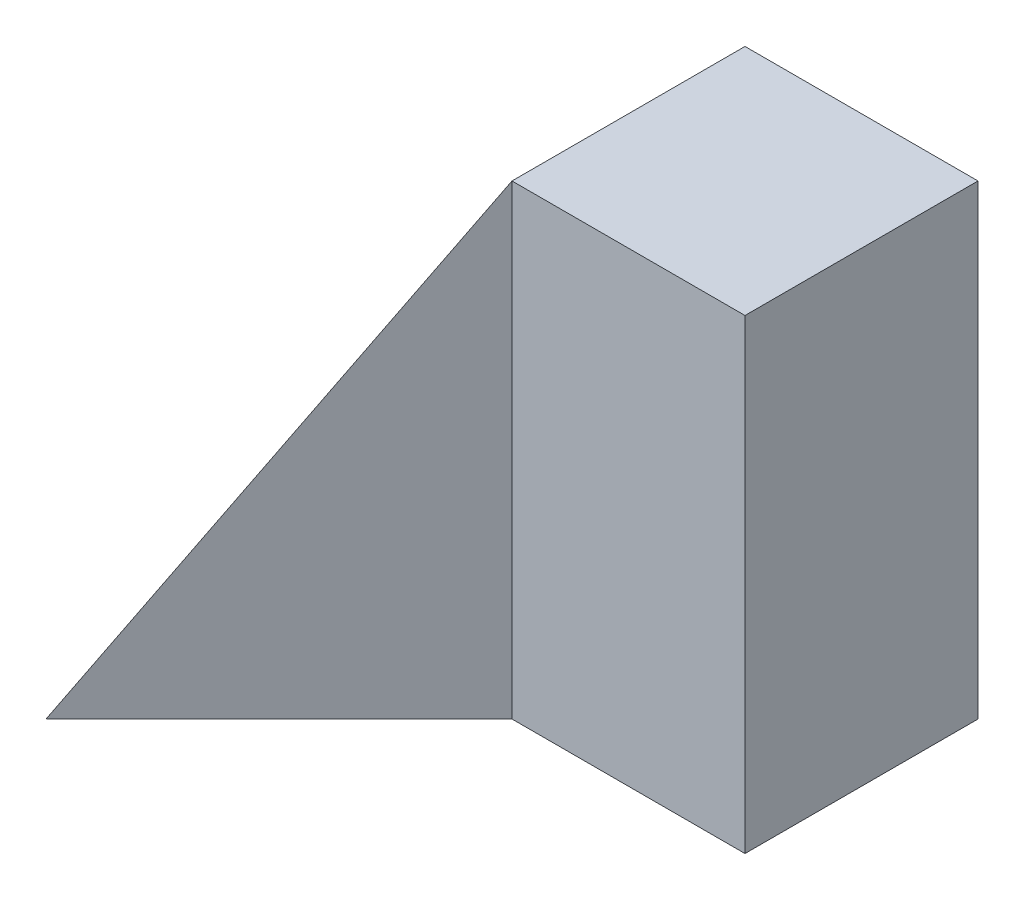
ISO-10303-21;
HEADER;
FILE_DESCRIPTION(('STEP AP214'),'2;1');
FILE_NAME('part.step','',(''),(''),'','','');
FILE_SCHEMA(('AUTOMOTIVE_DESIGN { 1 0 10303 214 1 1 1 1 }'));
ENDSEC;
DATA;
#1=APPLICATION_CONTEXT('core data for automotive mechanical design processes');
#2=APPLICATION_PROTOCOL_DEFINITION('international standard','automotive_design',2000,#1);
#3=PRODUCT_CONTEXT('',#1,'mechanical');
#4=PRODUCT('Part','Part','',(#3));
#5=PRODUCT_RELATED_PRODUCT_CATEGORY('part','',(#4));
#6=PRODUCT_DEFINITION_FORMATION('','',#4);
#7=PRODUCT_DEFINITION_CONTEXT('part definition',#1,'design');
#8=PRODUCT_DEFINITION('design','',#6,#7);
#9=PRODUCT_DEFINITION_SHAPE('','',#8);
#10=(LENGTH_UNIT() NAMED_UNIT(*) SI_UNIT(.MILLI.,.METRE.));
#11=(NAMED_UNIT(*) PLANE_ANGLE_UNIT() SI_UNIT($,.RADIAN.));
#12=(NAMED_UNIT(*) SI_UNIT($,.STERADIAN.) SOLID_ANGLE_UNIT());
#13=UNCERTAINTY_MEASURE_WITH_UNIT(LENGTH_MEASURE(1.E-05),#10,'distance_accuracy_value','');
#14=(GEOMETRIC_REPRESENTATION_CONTEXT(3) GLOBAL_UNCERTAINTY_ASSIGNED_CONTEXT((#13)) GLOBAL_UNIT_ASSIGNED_CONTEXT((#10,
#11,#12)) REPRESENTATION_CONTEXT('',''));
#15=CARTESIAN_POINT('',(0.,0.,0.));
#16=DIRECTION('',(0.,0.,1.));
#17=DIRECTION('',(1.,0.,0.));
#18=AXIS2_PLACEMENT_3D('',#15,#16,#17);
#19=CARTESIAN_POINT('',(0.,0.,40.));
#20=DIRECTION('',(0.,1.,0.));
#21=DIRECTION('',(0.,0.,1.));
#22=AXIS2_PLACEMENT_3D('',#19,#20,#21);
#23=PLANE('',#22);
#24=DIRECTION('',(0.,0.,-1.));
#25=VECTOR('',#24,1.);
#26=CARTESIAN_POINT('',(40.,0.,40.));
#27=LINE('',#26,#25);
#28=CARTESIAN_POINT('',(40.,0.,20.));
#29=VERTEX_POINT('',#28);
#30=CARTESIAN_POINT('',(40.,0.,0.));
#31=VERTEX_POINT('',#30);
#32=EDGE_CURVE('E94',#29,#31,#27,.T.);
#33=ORIENTED_EDGE('',*,*,#32,.F.);
#34=DIRECTION('',(1.,0.,0.));
#35=VECTOR('',#34,1.);
#36=CARTESIAN_POINT('',(40.,0.,20.));
#37=LINE('',#36,#35);
#38=CARTESIAN_POINT('',(20.,0.,20.));
#39=VERTEX_POINT('',#38);
#40=EDGE_CURVE('E77',#39,#29,#37,.T.);
#41=ORIENTED_EDGE('',*,*,#40,.F.);
#42=DIRECTION('',(0.707106781186548,0.,-0.707106781186548));
#43=VECTOR('',#42,1.);
#44=CARTESIAN_POINT('',(20.,0.,20.));
#45=LINE('',#44,#43);
#46=CARTESIAN_POINT('',(0.,0.,40.));
#47=VERTEX_POINT('',#46);
#48=EDGE_CURVE('E108',#47,#39,#45,.T.);
#49=ORIENTED_EDGE('',*,*,#48,.F.);
#50=DIRECTION('',(0.,0.,-1.));
#51=VECTOR('',#50,1.);
#52=CARTESIAN_POINT('',(0.,0.,40.));
#53=LINE('',#52,#51);
#54=CARTESIAN_POINT('',(0.,0.,0.));
#55=VERTEX_POINT('',#54);
#56=EDGE_CURVE('E40',#47,#55,#53,.T.);
#57=ORIENTED_EDGE('',*,*,#56,.T.);
#58=DIRECTION('',(1.,0.,0.));
#59=VECTOR('',#58,1.);
#60=CARTESIAN_POINT('',(0.,0.,0.));
#61=LINE('',#60,#59);
#62=EDGE_CURVE('E106',#55,#31,#61,.T.);
#63=ORIENTED_EDGE('',*,*,#62,.T.);
#64=EDGE_LOOP('',(#33,#41,#49,#57,#63));
#65=FACE_BOUND('',#64,.T.);
#66=ADVANCED_FACE('F33',(#65),#23,.F.);
#67=CARTESIAN_POINT('',(40.,0.,40.));
#68=DIRECTION('',(-1.,0.,0.));
#69=DIRECTION('',(0.,0.,1.));
#70=AXIS2_PLACEMENT_3D('',#67,#68,#69);
#71=PLANE('',#70);
#72=DIRECTION('',(0.,0.,-1.));
#73=VECTOR('',#72,1.);
#74=CARTESIAN_POINT('',(40.,40.,40.));
#75=LINE('',#74,#73);
#76=CARTESIAN_POINT('',(40.,40.,20.));
#77=VERTEX_POINT('',#76);
#78=CARTESIAN_POINT('',(40.,40.,0.));
#79=VERTEX_POINT('',#78);
#80=EDGE_CURVE('E87',#77,#79,#75,.T.);
#81=ORIENTED_EDGE('',*,*,#80,.F.);
#82=DIRECTION('',(0.,-1.,0.));
#83=VECTOR('',#82,1.);
#84=CARTESIAN_POINT('',(40.,40.,20.));
#85=LINE('',#84,#83);
#86=EDGE_CURVE('E74',#77,#29,#85,.T.);
#87=ORIENTED_EDGE('',*,*,#86,.T.);
#88=ORIENTED_EDGE('',*,*,#32,.T.);
#89=DIRECTION('',(0.,1.,0.));
#90=VECTOR('',#89,1.);
#91=CARTESIAN_POINT('',(40.,0.,0.));
#92=LINE('',#91,#90);
#93=EDGE_CURVE('E92',#31,#79,#92,.T.);
#94=ORIENTED_EDGE('',*,*,#93,.T.);
#95=EDGE_LOOP('',(#81,#87,#88,#94));
#96=FACE_BOUND('',#95,.T.);
#97=ADVANCED_FACE('F90',(#96),#71,.F.);
#98=CARTESIAN_POINT('',(0.,40.,40.));
#99=DIRECTION('',(0.,-1.,0.));
#100=DIRECTION('',(0.,0.,-1.));
#101=AXIS2_PLACEMENT_3D('',#98,#99,#100);
#102=PLANE('',#101);
#103=DIRECTION('',(0.,0.,1.));
#104=VECTOR('',#103,1.);
#105=CARTESIAN_POINT('',(20.,40.,0.));
#106=LINE('',#105,#104);
#107=CARTESIAN_POINT('',(20.,40.,0.));
#108=VERTEX_POINT('',#107);
#109=CARTESIAN_POINT('',(20.,40.,20.));
#110=VERTEX_POINT('',#109);
#111=EDGE_CURVE('E54',#108,#110,#106,.T.);
#112=ORIENTED_EDGE('',*,*,#111,.T.);
#113=DIRECTION('',(1.,0.,0.));
#114=VECTOR('',#113,1.);
#115=CARTESIAN_POINT('',(40.,40.,20.));
#116=LINE('',#115,#114);
#117=EDGE_CURVE('E47',#110,#77,#116,.T.);
#118=ORIENTED_EDGE('',*,*,#117,.T.);
#119=ORIENTED_EDGE('',*,*,#80,.T.);
#120=DIRECTION('',(-1.,0.,0.));
#121=VECTOR('',#120,1.);
#122=CARTESIAN_POINT('',(0.,40.,0.));
#123=LINE('',#122,#121);
#124=EDGE_CURVE('E95',#79,#108,#123,.T.);
#125=ORIENTED_EDGE('',*,*,#124,.T.);
#126=EDGE_LOOP('',(#112,#118,#119,#125));
#127=FACE_BOUND('',#126,.T.);
#128=ADVANCED_FACE('F85',(#127),#102,.F.);
#129=CARTESIAN_POINT('',(0.,0.,0.));
#130=DIRECTION('',(0.,0.,-1.));
#131=DIRECTION('',(-1.,0.,0.));
#132=AXIS2_PLACEMENT_3D('',#129,#130,#131);
#133=PLANE('',#132);
#134=DIRECTION('',(0.447213595499958,0.894427190999916,0.));
#135=VECTOR('',#134,1.);
#136=CARTESIAN_POINT('',(0.,0.,0.));
#137=LINE('',#136,#135);
#138=EDGE_CURVE('E81',#55,#108,#137,.T.);
#139=ORIENTED_EDGE('',*,*,#138,.T.);
#140=ORIENTED_EDGE('',*,*,#124,.F.);
#141=ORIENTED_EDGE('',*,*,#93,.F.);
#142=ORIENTED_EDGE('',*,*,#62,.F.);
#143=EDGE_LOOP('',(#139,#140,#141,#142));
#144=FACE_BOUND('',#143,.T.);
#145=ADVANCED_FACE('F112',(#144),#133,.T.);
#146=CARTESIAN_POINT('',(0.,0.,0.));
#147=DIRECTION('',(0.894427190999916,-0.447213595499958,0.));
#148=DIRECTION('',(0.447213595499958,0.894427190999916,0.));
#149=AXIS2_PLACEMENT_3D('',#146,#147,#148);
#150=PLANE('',#149);
#151=ORIENTED_EDGE('',*,*,#56,.F.);
#152=DIRECTION('',(0.408248290463863,0.816496580927726,-0.408248290463863));
#153=VECTOR('',#152,1.);
#154=CARTESIAN_POINT('',(6.66666666666667,13.3333333333333,33.3333333333333));
#155=LINE('',#154,#153);
#156=EDGE_CURVE('E11',#47,#110,#155,.T.);
#157=ORIENTED_EDGE('',*,*,#156,.T.);
#158=ORIENTED_EDGE('',*,*,#111,.F.);
#159=ORIENTED_EDGE('',*,*,#138,.F.);
#160=EDGE_LOOP('',(#151,#157,#158,#159));
#161=FACE_BOUND('',#160,.T.);
#162=ADVANCED_FACE('F109',(#161),#150,.F.);
#163=CARTESIAN_POINT('',(20.,40.,20.));
#164=DIRECTION('',(-0.707106781186548,0.,-0.707106781186548));
#165=DIRECTION('',(-0.707106781186548,0.,0.707106781186548));
#166=AXIS2_PLACEMENT_3D('',#163,#164,#165);
#167=PLANE('',#166);
#168=ORIENTED_EDGE('',*,*,#48,.T.);
#169=DIRECTION('',(0.,-1.,0.));
#170=VECTOR('',#169,1.);
#171=CARTESIAN_POINT('',(20.,40.,20.));
#172=LINE('',#171,#170);
#173=EDGE_CURVE('E82',#110,#39,#172,.T.);
#174=ORIENTED_EDGE('',*,*,#173,.F.);
#175=ORIENTED_EDGE('',*,*,#156,.F.);
#176=EDGE_LOOP('',(#168,#174,#175));
#177=FACE_BOUND('',#176,.T.);
#178=ADVANCED_FACE('F119',(#177),#167,.F.);
#179=CARTESIAN_POINT('',(40.,40.,20.));
#180=DIRECTION('',(0.,0.,-1.));
#181=DIRECTION('',(-1.,0.,0.));
#182=AXIS2_PLACEMENT_3D('',#179,#180,#181);
#183=PLANE('',#182);
#184=ORIENTED_EDGE('',*,*,#40,.T.);
#185=ORIENTED_EDGE('',*,*,#86,.F.);
#186=ORIENTED_EDGE('',*,*,#117,.F.);
#187=ORIENTED_EDGE('',*,*,#173,.T.);
#188=EDGE_LOOP('',(#184,#185,#186,#187));
#189=FACE_BOUND('',#188,.T.);
#190=ADVANCED_FACE('F75',(#189),#183,.F.);
#191=CLOSED_SHELL('',(#66,#97,#128,#145,#162,#178,#190));
#192=MANIFOLD_SOLID_BREP('B2',#191);
#193=ADVANCED_BREP_SHAPE_REPRESENTATION('',(#18,#192),#14);
#194=SHAPE_DEFINITION_REPRESENTATION(#9,#193);
ENDSEC;
END-ISO-10303-21;
